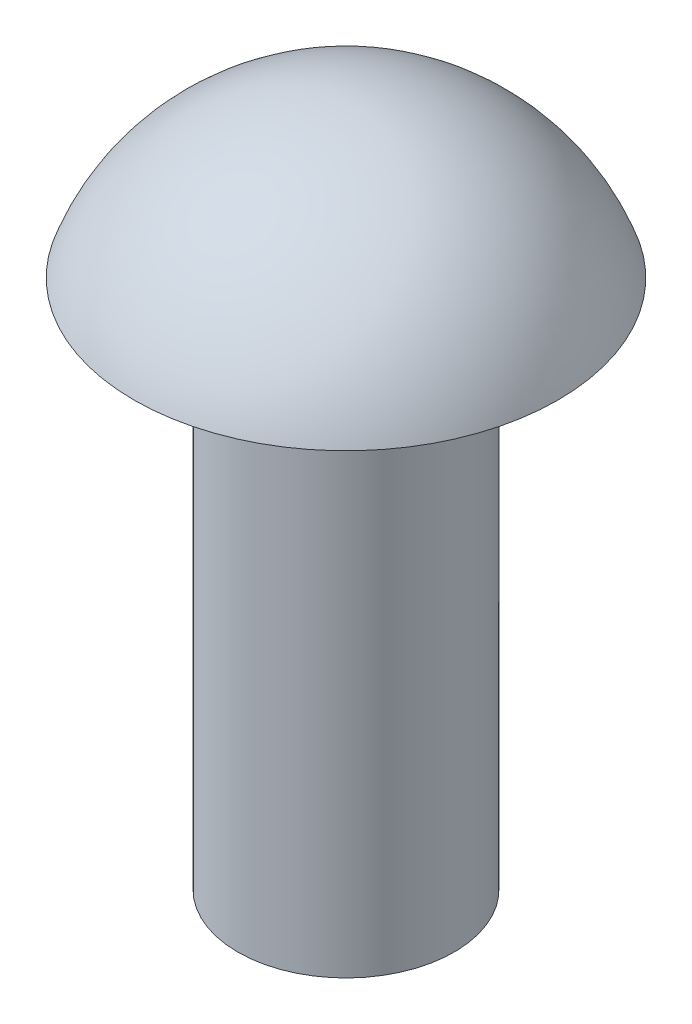
ISO-10303-21;
HEADER;
FILE_DESCRIPTION(('STEP AP214'),'2;1');
FILE_NAME('part.step','',(''),(''),'','','');
FILE_SCHEMA(('AUTOMOTIVE_DESIGN { 1 0 10303 214 1 1 1 1 }'));
ENDSEC;
DATA;
#1=APPLICATION_CONTEXT('core data for automotive mechanical design processes');
#2=APPLICATION_PROTOCOL_DEFINITION('international standard','automotive_design',2000,#1);
#3=PRODUCT_CONTEXT('',#1,'mechanical');
#4=PRODUCT('Part','Part','',(#3));
#5=PRODUCT_RELATED_PRODUCT_CATEGORY('part','',(#4));
#6=PRODUCT_DEFINITION_FORMATION('','',#4);
#7=PRODUCT_DEFINITION_CONTEXT('part definition',#1,'design');
#8=PRODUCT_DEFINITION('design','',#6,#7);
#9=PRODUCT_DEFINITION_SHAPE('','',#8);
#10=(LENGTH_UNIT() NAMED_UNIT(*) SI_UNIT(.MILLI.,.METRE.));
#11=(NAMED_UNIT(*) PLANE_ANGLE_UNIT() SI_UNIT($,.RADIAN.));
#12=(NAMED_UNIT(*) SI_UNIT($,.STERADIAN.) SOLID_ANGLE_UNIT());
#13=UNCERTAINTY_MEASURE_WITH_UNIT(LENGTH_MEASURE(1.E-05),#10,'distance_accuracy_value','');
#14=(GEOMETRIC_REPRESENTATION_CONTEXT(3) GLOBAL_UNCERTAINTY_ASSIGNED_CONTEXT((#13)) GLOBAL_UNIT_ASSIGNED_CONTEXT((#10,
#11,#12)) REPRESENTATION_CONTEXT('',''));
#15=CARTESIAN_POINT('',(0.,0.,0.));
#16=DIRECTION('',(0.,0.,1.));
#17=DIRECTION('',(1.,0.,0.));
#18=AXIS2_PLACEMENT_3D('',#15,#16,#17);
#19=CARTESIAN_POINT('',(0.,-2.54411764705882,0.));
#20=DIRECTION('',(0.,1.,0.));
#21=DIRECTION('',(0.,0.,-1.));
#22=AXIS2_PLACEMENT_3D('',#19,#20,#21);
#23=SPHERICAL_SURFACE('',#22,2.54411764705882);
#24=CARTESIAN_POINT('',(0.,-1.7,0.));
#25=DIRECTION('',(0.,1.,0.));
#26=DIRECTION('',(0.,0.,1.));
#27=AXIS2_PLACEMENT_3D('',#24,#25,#26);
#28=CIRCLE('',#27,2.4);
#29=CARTESIAN_POINT('',(0.,-1.7,2.4));
#30=VERTEX_POINT('',#29);
#31=EDGE_CURVE('E47',#30,#30,#28,.T.);
#32=ORIENTED_EDGE('',*,*,#31,.T.);
#33=EDGE_LOOP('',(#32));
#34=FACE_BOUND('',#33,.T.);
#35=ADVANCED_FACE('F37',(#34),#23,.T.);
#36=CARTESIAN_POINT('',(0.,-7.7,0.));
#37=DIRECTION('',(0.,1.,0.));
#38=DIRECTION('',(0.,0.,1.));
#39=AXIS2_PLACEMENT_3D('',#36,#37,#38);
#40=PLANE('',#39);
#41=CARTESIAN_POINT('',(0.,-7.7,0.));
#42=DIRECTION('',(0.,1.,0.));
#43=DIRECTION('',(0.,0.,1.));
#44=AXIS2_PLACEMENT_3D('',#41,#42,#43);
#45=CIRCLE('',#44,1.225);
#46=CARTESIAN_POINT('',(0.,-7.7,1.225));
#47=VERTEX_POINT('',#46);
#48=EDGE_CURVE('E10',#47,#47,#45,.T.);
#49=ORIENTED_EDGE('',*,*,#48,.F.);
#50=EDGE_LOOP('',(#49));
#51=FACE_BOUND('',#50,.T.);
#52=ADVANCED_FACE('F62',(#51),#40,.F.);
#53=CARTESIAN_POINT('',(0.,0.,0.));
#54=DIRECTION('',(0.,1.,0.));
#55=DIRECTION('',(0.,0.,1.));
#56=AXIS2_PLACEMENT_3D('',#53,#54,#55);
#57=CYLINDRICAL_SURFACE('',#56,1.225);
#58=CARTESIAN_POINT('',(0.,-1.7,0.));
#59=DIRECTION('',(0.,1.,0.));
#60=DIRECTION('',(0.,0.,1.));
#61=AXIS2_PLACEMENT_3D('',#58,#59,#60);
#62=CIRCLE('',#61,1.225);
#63=CARTESIAN_POINT('',(0.,-1.7,1.225));
#64=VERTEX_POINT('',#63);
#65=EDGE_CURVE('E43',#64,#64,#62,.T.);
#66=ORIENTED_EDGE('',*,*,#65,.F.);
#67=EDGE_LOOP('',(#66));
#68=FACE_BOUND('',#67,.T.);
#69=ORIENTED_EDGE('',*,*,#48,.T.);
#70=EDGE_LOOP('',(#69));
#71=FACE_BOUND('',#70,.T.);
#72=ADVANCED_FACE('F57',(#68,#71),#57,.T.);
#73=CARTESIAN_POINT('',(0.,-1.7,-1.225));
#74=DIRECTION('',(0.,1.,0.));
#75=DIRECTION('',(0.,0.,1.));
#76=AXIS2_PLACEMENT_3D('',#73,#74,#75);
#77=PLANE('',#76);
#78=ORIENTED_EDGE('',*,*,#31,.F.);
#79=EDGE_LOOP('',(#78));
#80=FACE_BOUND('',#79,.T.);
#81=ORIENTED_EDGE('',*,*,#65,.T.);
#82=EDGE_LOOP('',(#81));
#83=FACE_BOUND('',#82,.T.);
#84=ADVANCED_FACE('F55',(#80,#83),#77,.F.);
#85=CLOSED_SHELL('',(#35,#52,#72,#84));
#86=MANIFOLD_SOLID_BREP('B2',#85);
#87=ADVANCED_BREP_SHAPE_REPRESENTATION('',(#18,#86),#14);
#88=SHAPE_DEFINITION_REPRESENTATION(#9,#87);
ENDSEC;
END-ISO-10303-21;
